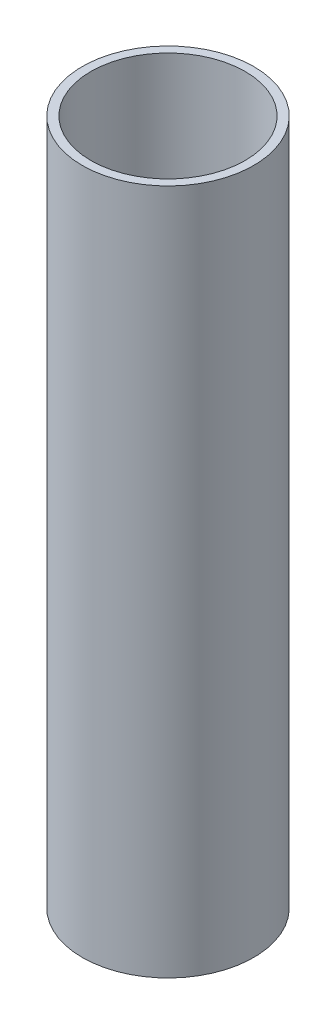
ISO-10303-21;
HEADER;
FILE_DESCRIPTION(('STEP AP214'),'2;1');
FILE_NAME('part.step','',(''),(''),'','','');
FILE_SCHEMA(('AUTOMOTIVE_DESIGN { 1 0 10303 214 1 1 1 1 }'));
ENDSEC;
DATA;
#1=APPLICATION_CONTEXT('core data for automotive mechanical design processes');
#2=APPLICATION_PROTOCOL_DEFINITION('international standard','automotive_design',2000,#1);
#3=PRODUCT_CONTEXT('',#1,'mechanical');
#4=PRODUCT('Part','Part','',(#3));
#5=PRODUCT_RELATED_PRODUCT_CATEGORY('part','',(#4));
#6=PRODUCT_DEFINITION_FORMATION('','',#4);
#7=PRODUCT_DEFINITION_CONTEXT('part definition',#1,'design');
#8=PRODUCT_DEFINITION('design','',#6,#7);
#9=PRODUCT_DEFINITION_SHAPE('','',#8);
#10=(LENGTH_UNIT() NAMED_UNIT(*) SI_UNIT(.MILLI.,.METRE.));
#11=(NAMED_UNIT(*) PLANE_ANGLE_UNIT() SI_UNIT($,.RADIAN.));
#12=(NAMED_UNIT(*) SI_UNIT($,.STERADIAN.) SOLID_ANGLE_UNIT());
#13=UNCERTAINTY_MEASURE_WITH_UNIT(LENGTH_MEASURE(1.E-05),#10,'distance_accuracy_value','');
#14=(GEOMETRIC_REPRESENTATION_CONTEXT(3) GLOBAL_UNCERTAINTY_ASSIGNED_CONTEXT((#13)) GLOBAL_UNIT_ASSIGNED_CONTEXT((#10,
#11,#12)) REPRESENTATION_CONTEXT('',''));
#15=CARTESIAN_POINT('',(0.,0.,0.));
#16=DIRECTION('',(0.,0.,1.));
#17=DIRECTION('',(1.,0.,0.));
#18=AXIS2_PLACEMENT_3D('',#15,#16,#17);
#19=CARTESIAN_POINT('',(0.,200.,0.));
#20=DIRECTION('',(0.,1.,0.));
#21=DIRECTION('',(0.,0.,1.));
#22=AXIS2_PLACEMENT_3D('',#19,#20,#21);
#23=PLANE('',#22);
#24=CARTESIAN_POINT('',(0.,200.,0.));
#25=DIRECTION('',(0.,1.,0.));
#26=DIRECTION('',(0.,0.,1.));
#27=AXIS2_PLACEMENT_3D('',#24,#25,#26);
#28=CIRCLE('',#27,25.);
#29=CARTESIAN_POINT('',(0.,200.,25.));
#30=VERTEX_POINT('',#29);
#31=EDGE_CURVE('E10',#30,#30,#28,.T.);
#32=ORIENTED_EDGE('',*,*,#31,.T.);
#33=EDGE_LOOP('',(#32));
#34=FACE_BOUND('',#33,.T.);
#35=CARTESIAN_POINT('',(0.,200.,0.));
#36=DIRECTION('',(0.,1.,0.));
#37=DIRECTION('',(0.,0.,1.));
#38=AXIS2_PLACEMENT_3D('',#35,#36,#37);
#39=CIRCLE('',#38,22.5);
#40=CARTESIAN_POINT('',(0.,200.,22.5));
#41=VERTEX_POINT('',#40);
#42=EDGE_CURVE('E50',#41,#41,#39,.T.);
#43=ORIENTED_EDGE('',*,*,#42,.F.);
#44=EDGE_LOOP('',(#43));
#45=FACE_BOUND('',#44,.T.);
#46=ADVANCED_FACE('F37',(#34,#45),#23,.T.);
#47=CARTESIAN_POINT('',(0.,0.,0.));
#48=DIRECTION('',(0.,1.,0.));
#49=DIRECTION('',(0.,0.,1.));
#50=AXIS2_PLACEMENT_3D('',#47,#48,#49);
#51=PLANE('',#50);
#52=CARTESIAN_POINT('',(0.,0.,0.));
#53=DIRECTION('',(0.,1.,0.));
#54=DIRECTION('',(0.,0.,1.));
#55=AXIS2_PLACEMENT_3D('',#52,#53,#54);
#56=CIRCLE('',#55,25.);
#57=CARTESIAN_POINT('',(0.,0.,25.));
#58=VERTEX_POINT('',#57);
#59=EDGE_CURVE('E41',#58,#58,#56,.T.);
#60=ORIENTED_EDGE('',*,*,#59,.F.);
#61=EDGE_LOOP('',(#60));
#62=FACE_BOUND('',#61,.T.);
#63=CARTESIAN_POINT('',(0.,0.,0.));
#64=DIRECTION('',(0.,1.,0.));
#65=DIRECTION('',(0.,0.,1.));
#66=AXIS2_PLACEMENT_3D('',#63,#64,#65);
#67=CIRCLE('',#66,22.5);
#68=CARTESIAN_POINT('',(0.,0.,22.5));
#69=VERTEX_POINT('',#68);
#70=EDGE_CURVE('E52',#69,#69,#67,.T.);
#71=ORIENTED_EDGE('',*,*,#70,.T.);
#72=EDGE_LOOP('',(#71));
#73=FACE_BOUND('',#72,.T.);
#74=ADVANCED_FACE('F64',(#62,#73),#51,.F.);
#75=CARTESIAN_POINT('',(0.,200.,0.));
#76=DIRECTION('',(0.,-1.,0.));
#77=DIRECTION('',(0.,0.,-1.));
#78=AXIS2_PLACEMENT_3D('',#75,#76,#77);
#79=CYLINDRICAL_SURFACE('',#78,25.);
#80=ORIENTED_EDGE('',*,*,#31,.F.);
#81=EDGE_LOOP('',(#80));
#82=FACE_BOUND('',#81,.T.);
#83=ORIENTED_EDGE('',*,*,#59,.T.);
#84=EDGE_LOOP('',(#83));
#85=FACE_BOUND('',#84,.T.);
#86=ADVANCED_FACE('F39',(#82,#85),#79,.T.);
#87=CARTESIAN_POINT('',(0.,200.,0.));
#88=DIRECTION('',(0.,-1.,0.));
#89=DIRECTION('',(0.,0.,-1.));
#90=AXIS2_PLACEMENT_3D('',#87,#88,#89);
#91=CYLINDRICAL_SURFACE('',#90,22.5);
#92=ORIENTED_EDGE('',*,*,#42,.T.);
#93=EDGE_LOOP('',(#92));
#94=FACE_BOUND('',#93,.T.);
#95=ORIENTED_EDGE('',*,*,#70,.F.);
#96=EDGE_LOOP('',(#95));
#97=FACE_BOUND('',#96,.T.);
#98=ADVANCED_FACE('F60',(#94,#97),#91,.F.);
#99=CLOSED_SHELL('',(#46,#74,#86,#98));
#100=MANIFOLD_SOLID_BREP('B2',#99);
#101=ADVANCED_BREP_SHAPE_REPRESENTATION('',(#18,#100),#14);
#102=SHAPE_DEFINITION_REPRESENTATION(#9,#101);
ENDSEC;
END-ISO-10303-21;
